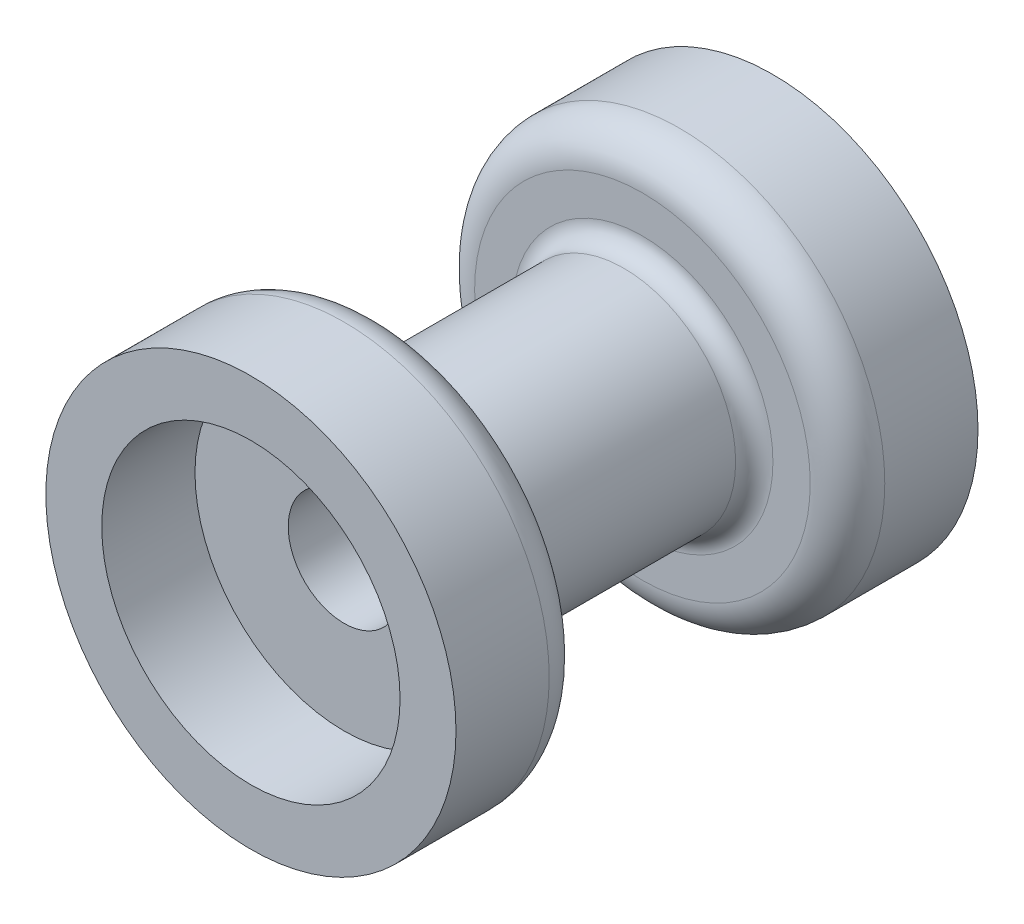
ISO-10303-21;
HEADER;
FILE_DESCRIPTION(('STEP AP214'),'2;1');
FILE_NAME('part.step','',(''),(''),'','','');
FILE_SCHEMA(('AUTOMOTIVE_DESIGN { 1 0 10303 214 1 1 1 1 }'));
ENDSEC;
DATA;
#1=APPLICATION_CONTEXT('core data for automotive mechanical design processes');
#2=APPLICATION_PROTOCOL_DEFINITION('international standard','automotive_design',2000,#1);
#3=PRODUCT_CONTEXT('',#1,'mechanical');
#4=PRODUCT('Part','Part','',(#3));
#5=PRODUCT_RELATED_PRODUCT_CATEGORY('part','',(#4));
#6=PRODUCT_DEFINITION_FORMATION('','',#4);
#7=PRODUCT_DEFINITION_CONTEXT('part definition',#1,'design');
#8=PRODUCT_DEFINITION('design','',#6,#7);
#9=PRODUCT_DEFINITION_SHAPE('','',#8);
#10=(LENGTH_UNIT() NAMED_UNIT(*) SI_UNIT(.MILLI.,.METRE.));
#11=(NAMED_UNIT(*) PLANE_ANGLE_UNIT() SI_UNIT($,.RADIAN.));
#12=(NAMED_UNIT(*) SI_UNIT($,.STERADIAN.) SOLID_ANGLE_UNIT());
#13=UNCERTAINTY_MEASURE_WITH_UNIT(LENGTH_MEASURE(1.E-05),#10,'distance_accuracy_value','');
#14=(GEOMETRIC_REPRESENTATION_CONTEXT(3) GLOBAL_UNCERTAINTY_ASSIGNED_CONTEXT((#13)) GLOBAL_UNIT_ASSIGNED_CONTEXT((#10,
#11,#12)) REPRESENTATION_CONTEXT('',''));
#15=CARTESIAN_POINT('',(0.,0.,0.));
#16=DIRECTION('',(0.,0.,1.));
#17=DIRECTION('',(1.,0.,0.));
#18=AXIS2_PLACEMENT_3D('',#15,#16,#17);
#19=CARTESIAN_POINT('',(0.,0.,0.));
#20=DIRECTION('',(0.,0.,1.));
#21=DIRECTION('',(1.,0.,0.));
#22=AXIS2_PLACEMENT_3D('',#19,#20,#21);
#23=CYLINDRICAL_SURFACE('',#22,8.);
#24=CARTESIAN_POINT('',(0.,0.,-5.));
#25=DIRECTION('',(0.,0.,1.));
#26=DIRECTION('',(1.,0.,0.));
#27=AXIS2_PLACEMENT_3D('',#24,#25,#26);
#28=CIRCLE('',#27,8.);
#29=CARTESIAN_POINT('',(8.,0.,-5.));
#30=VERTEX_POINT('',#29);
#31=EDGE_CURVE('E10',#30,#30,#28,.T.);
#32=ORIENTED_EDGE('',*,*,#31,.F.);
#33=EDGE_LOOP('',(#32));
#34=FACE_BOUND('',#33,.T.);
#35=CARTESIAN_POINT('',(0.,0.,0.));
#36=DIRECTION('',(0.,0.,1.));
#37=DIRECTION('',(1.,0.,0.));
#38=AXIS2_PLACEMENT_3D('',#35,#36,#37);
#39=CIRCLE('',#38,8.);
#40=CARTESIAN_POINT('',(8.,0.,0.));
#41=VERTEX_POINT('',#40);
#42=EDGE_CURVE('E83',#41,#41,#39,.T.);
#43=ORIENTED_EDGE('',*,*,#42,.T.);
#44=EDGE_LOOP('',(#43));
#45=FACE_BOUND('',#44,.T.);
#46=ADVANCED_FACE('F31',(#34,#45),#23,.F.);
#47=CARTESIAN_POINT('',(0.,3.,-5.));
#48=DIRECTION('',(0.,0.,-1.));
#49=DIRECTION('',(-1.,0.,0.));
#50=AXIS2_PLACEMENT_3D('',#47,#48,#49);
#51=PLANE('',#50);
#52=CARTESIAN_POINT('',(0.,0.,-5.));
#53=DIRECTION('',(0.,0.,1.));
#54=DIRECTION('',(1.,0.,0.));
#55=AXIS2_PLACEMENT_3D('',#52,#53,#54);
#56=CIRCLE('',#55,3.);
#57=CARTESIAN_POINT('',(3.,0.,-5.));
#58=VERTEX_POINT('',#57);
#59=EDGE_CURVE('E37',#58,#58,#56,.T.);
#60=ORIENTED_EDGE('',*,*,#59,.F.);
#61=EDGE_LOOP('',(#60));
#62=FACE_BOUND('',#61,.T.);
#63=ORIENTED_EDGE('',*,*,#31,.T.);
#64=EDGE_LOOP('',(#63));
#65=FACE_BOUND('',#64,.T.);
#66=ADVANCED_FACE('F168',(#62,#65),#51,.F.);
#67=CARTESIAN_POINT('',(0.,0.,0.));
#68=DIRECTION('',(0.,0.,1.));
#69=DIRECTION('',(1.,0.,0.));
#70=AXIS2_PLACEMENT_3D('',#67,#68,#69);
#71=CYLINDRICAL_SURFACE('',#70,3.);
#72=CARTESIAN_POINT('',(0.,0.,-23.));
#73=DIRECTION('',(0.,0.,1.));
#74=DIRECTION('',(1.,0.,0.));
#75=AXIS2_PLACEMENT_3D('',#72,#73,#74);
#76=CIRCLE('',#75,3.);
#77=CARTESIAN_POINT('',(3.,0.,-23.));
#78=VERTEX_POINT('',#77);
#79=EDGE_CURVE('E41',#78,#78,#76,.T.);
#80=ORIENTED_EDGE('',*,*,#79,.F.);
#81=EDGE_LOOP('',(#80));
#82=FACE_BOUND('',#81,.T.);
#83=ORIENTED_EDGE('',*,*,#59,.T.);
#84=EDGE_LOOP('',(#83));
#85=FACE_BOUND('',#84,.T.);
#86=ADVANCED_FACE('F163',(#82,#85),#71,.F.);
#87=CARTESIAN_POINT('',(0.,8.00000000000001,-23.));
#88=DIRECTION('',(0.,0.,1.));
#89=DIRECTION('',(1.,0.,0.));
#90=AXIS2_PLACEMENT_3D('',#87,#88,#89);
#91=PLANE('',#90);
#92=CARTESIAN_POINT('',(0.,0.,-23.));
#93=DIRECTION('',(0.,0.,1.));
#94=DIRECTION('',(1.,0.,0.));
#95=AXIS2_PLACEMENT_3D('',#92,#93,#94);
#96=CIRCLE('',#95,8.00000000000001);
#97=CARTESIAN_POINT('',(8.00000000000001,0.,-23.));
#98=VERTEX_POINT('',#97);
#99=EDGE_CURVE('E45',#98,#98,#96,.T.);
#100=ORIENTED_EDGE('',*,*,#99,.F.);
#101=EDGE_LOOP('',(#100));
#102=FACE_BOUND('',#101,.T.);
#103=ORIENTED_EDGE('',*,*,#79,.T.);
#104=EDGE_LOOP('',(#103));
#105=FACE_BOUND('',#104,.T.);
#106=ADVANCED_FACE('F157',(#102,#105),#91,.F.);
#107=CARTESIAN_POINT('',(0.,0.,0.));
#108=DIRECTION('',(0.,0.,1.));
#109=DIRECTION('',(1.,0.,0.));
#110=AXIS2_PLACEMENT_3D('',#107,#108,#109);
#111=CYLINDRICAL_SURFACE('',#110,8.);
#112=CARTESIAN_POINT('',(0.,0.,-28.));
#113=DIRECTION('',(0.,0.,1.));
#114=DIRECTION('',(1.,0.,0.));
#115=AXIS2_PLACEMENT_3D('',#112,#113,#114);
#116=CIRCLE('',#115,8.);
#117=CARTESIAN_POINT('',(8.,0.,-28.));
#118=VERTEX_POINT('',#117);
#119=EDGE_CURVE('E50',#118,#118,#116,.T.);
#120=ORIENTED_EDGE('',*,*,#119,.F.);
#121=EDGE_LOOP('',(#120));
#122=FACE_BOUND('',#121,.T.);
#123=ORIENTED_EDGE('',*,*,#99,.T.);
#124=EDGE_LOOP('',(#123));
#125=FACE_BOUND('',#124,.T.);
#126=ADVANCED_FACE('F151',(#122,#125),#111,.F.);
#127=CARTESIAN_POINT('',(0.,11.,-28.));
#128=DIRECTION('',(0.,0.,1.));
#129=DIRECTION('',(1.,0.,0.));
#130=AXIS2_PLACEMENT_3D('',#127,#128,#129);
#131=PLANE('',#130);
#132=CARTESIAN_POINT('',(0.,0.,-28.));
#133=DIRECTION('',(0.,0.,1.));
#134=DIRECTION('',(1.,0.,0.));
#135=AXIS2_PLACEMENT_3D('',#132,#133,#134);
#136=CIRCLE('',#135,11.);
#137=CARTESIAN_POINT('',(11.,0.,-28.));
#138=VERTEX_POINT('',#137);
#139=EDGE_CURVE('E53',#138,#138,#136,.T.);
#140=ORIENTED_EDGE('',*,*,#139,.F.);
#141=EDGE_LOOP('',(#140));
#142=FACE_BOUND('',#141,.T.);
#143=ORIENTED_EDGE('',*,*,#119,.T.);
#144=EDGE_LOOP('',(#143));
#145=FACE_BOUND('',#144,.T.);
#146=ADVANCED_FACE('F145',(#142,#145),#131,.F.);
#147=CARTESIAN_POINT('',(0.,0.,0.));
#148=DIRECTION('',(0.,0.,1.));
#149=DIRECTION('',(1.,0.,0.));
#150=AXIS2_PLACEMENT_3D('',#147,#148,#149);
#151=CYLINDRICAL_SURFACE('',#150,11.);
#152=CARTESIAN_POINT('',(0.,0.,-23.));
#153=DIRECTION('',(0.,0.,1.));
#154=DIRECTION('',(1.,0.,0.));
#155=AXIS2_PLACEMENT_3D('',#152,#153,#154);
#156=CIRCLE('',#155,11.);
#157=CARTESIAN_POINT('',(11.,0.,-23.));
#158=VERTEX_POINT('',#157);
#159=EDGE_CURVE('E56',#158,#158,#156,.T.);
#160=ORIENTED_EDGE('',*,*,#159,.F.);
#161=EDGE_LOOP('',(#160));
#162=FACE_BOUND('',#161,.T.);
#163=ORIENTED_EDGE('',*,*,#139,.T.);
#164=EDGE_LOOP('',(#163));
#165=FACE_BOUND('',#164,.T.);
#166=ADVANCED_FACE('F139',(#162,#165),#151,.T.);
#167=CARTESIAN_POINT('',(0.,0.,-23.));
#168=DIRECTION('',(0.,0.,1.));
#169=DIRECTION('',(1.,0.,0.));
#170=AXIS2_PLACEMENT_3D('',#167,#168,#169);
#171=TOROIDAL_SURFACE('',#170,9.,2.);
#172=CARTESIAN_POINT('',(0.,0.,-21.));
#173=DIRECTION('',(0.,0.,1.));
#174=DIRECTION('',(1.,0.,0.));
#175=AXIS2_PLACEMENT_3D('',#172,#173,#174);
#176=CIRCLE('',#175,9.);
#177=CARTESIAN_POINT('',(9.,0.,-21.));
#178=VERTEX_POINT('',#177);
#179=EDGE_CURVE('E59',#178,#178,#176,.T.);
#180=ORIENTED_EDGE('',*,*,#179,.F.);
#181=EDGE_LOOP('',(#180));
#182=FACE_BOUND('',#181,.T.);
#183=ORIENTED_EDGE('',*,*,#159,.T.);
#184=EDGE_LOOP('',(#183));
#185=FACE_BOUND('',#184,.T.);
#186=ADVANCED_FACE('F133',(#182,#185),#171,.T.);
#187=CARTESIAN_POINT('',(0.,7.,-21.));
#188=DIRECTION('',(0.,0.,-1.));
#189=DIRECTION('',(-1.,0.,0.));
#190=AXIS2_PLACEMENT_3D('',#187,#188,#189);
#191=PLANE('',#190);
#192=CARTESIAN_POINT('',(0.,0.,-21.));
#193=DIRECTION('',(0.,0.,1.));
#194=DIRECTION('',(1.,0.,0.));
#195=AXIS2_PLACEMENT_3D('',#192,#193,#194);
#196=CIRCLE('',#195,7.);
#197=CARTESIAN_POINT('',(7.,0.,-21.));
#198=VERTEX_POINT('',#197);
#199=EDGE_CURVE('E62',#198,#198,#196,.T.);
#200=ORIENTED_EDGE('',*,*,#199,.F.);
#201=EDGE_LOOP('',(#200));
#202=FACE_BOUND('',#201,.T.);
#203=ORIENTED_EDGE('',*,*,#179,.T.);
#204=EDGE_LOOP('',(#203));
#205=FACE_BOUND('',#204,.T.);
#206=ADVANCED_FACE('F127',(#202,#205),#191,.F.);
#207=CARTESIAN_POINT('',(0.,0.,-20.));
#208=DIRECTION('',(0.,0.,1.));
#209=DIRECTION('',(1.,0.,0.));
#210=AXIS2_PLACEMENT_3D('',#207,#208,#209);
#211=TOROIDAL_SURFACE('',#210,7.,1.);
#212=CARTESIAN_POINT('',(0.,0.,-20.));
#213=DIRECTION('',(0.,0.,1.));
#214=DIRECTION('',(1.,0.,0.));
#215=AXIS2_PLACEMENT_3D('',#212,#213,#214);
#216=CIRCLE('',#215,6.);
#217=CARTESIAN_POINT('',(6.,0.,-20.));
#218=VERTEX_POINT('',#217);
#219=EDGE_CURVE('E65',#218,#218,#216,.T.);
#220=ORIENTED_EDGE('',*,*,#219,.F.);
#221=EDGE_LOOP('',(#220));
#222=FACE_BOUND('',#221,.T.);
#223=ORIENTED_EDGE('',*,*,#199,.T.);
#224=EDGE_LOOP('',(#223));
#225=FACE_BOUND('',#224,.T.);
#226=ADVANCED_FACE('F121',(#222,#225),#211,.F.);
#227=CARTESIAN_POINT('',(0.,0.,0.));
#228=DIRECTION('',(0.,0.,1.));
#229=DIRECTION('',(1.,0.,0.));
#230=AXIS2_PLACEMENT_3D('',#227,#228,#229);
#231=CYLINDRICAL_SURFACE('',#230,6.);
#232=CARTESIAN_POINT('',(0.,0.,-8.));
#233=DIRECTION('',(0.,0.,1.));
#234=DIRECTION('',(1.,0.,0.));
#235=AXIS2_PLACEMENT_3D('',#232,#233,#234);
#236=CIRCLE('',#235,6.);
#237=CARTESIAN_POINT('',(6.,0.,-8.));
#238=VERTEX_POINT('',#237);
#239=EDGE_CURVE('E68',#238,#238,#236,.T.);
#240=ORIENTED_EDGE('',*,*,#239,.F.);
#241=EDGE_LOOP('',(#240));
#242=FACE_BOUND('',#241,.T.);
#243=ORIENTED_EDGE('',*,*,#219,.T.);
#244=EDGE_LOOP('',(#243));
#245=FACE_BOUND('',#244,.T.);
#246=ADVANCED_FACE('F115',(#242,#245),#231,.T.);
#247=CARTESIAN_POINT('',(0.,0.,-8.));
#248=DIRECTION('',(0.,0.,1.));
#249=DIRECTION('',(1.,0.,0.));
#250=AXIS2_PLACEMENT_3D('',#247,#248,#249);
#251=TOROIDAL_SURFACE('',#250,7.,1.);
#252=CARTESIAN_POINT('',(0.,0.,-7.));
#253=DIRECTION('',(0.,0.,1.));
#254=DIRECTION('',(1.,0.,0.));
#255=AXIS2_PLACEMENT_3D('',#252,#253,#254);
#256=CIRCLE('',#255,7.);
#257=CARTESIAN_POINT('',(7.,0.,-7.));
#258=VERTEX_POINT('',#257);
#259=EDGE_CURVE('E71',#258,#258,#256,.T.);
#260=ORIENTED_EDGE('',*,*,#259,.F.);
#261=EDGE_LOOP('',(#260));
#262=FACE_BOUND('',#261,.T.);
#263=ORIENTED_EDGE('',*,*,#239,.T.);
#264=EDGE_LOOP('',(#263));
#265=FACE_BOUND('',#264,.T.);
#266=ADVANCED_FACE('F109',(#262,#265),#251,.F.);
#267=CARTESIAN_POINT('',(0.,9.,-7.));
#268=DIRECTION('',(0.,0.,1.));
#269=DIRECTION('',(1.,0.,0.));
#270=AXIS2_PLACEMENT_3D('',#267,#268,#269);
#271=PLANE('',#270);
#272=CARTESIAN_POINT('',(0.,0.,-7.));
#273=DIRECTION('',(0.,0.,1.));
#274=DIRECTION('',(1.,0.,0.));
#275=AXIS2_PLACEMENT_3D('',#272,#273,#274);
#276=CIRCLE('',#275,9.);
#277=CARTESIAN_POINT('',(9.,0.,-7.));
#278=VERTEX_POINT('',#277);
#279=EDGE_CURVE('E74',#278,#278,#276,.T.);
#280=ORIENTED_EDGE('',*,*,#279,.F.);
#281=EDGE_LOOP('',(#280));
#282=FACE_BOUND('',#281,.T.);
#283=ORIENTED_EDGE('',*,*,#259,.T.);
#284=EDGE_LOOP('',(#283));
#285=FACE_BOUND('',#284,.T.);
#286=ADVANCED_FACE('F103',(#282,#285),#271,.F.);
#287=CARTESIAN_POINT('',(0.,0.,-5.));
#288=DIRECTION('',(0.,0.,1.));
#289=DIRECTION('',(1.,0.,0.));
#290=AXIS2_PLACEMENT_3D('',#287,#288,#289);
#291=TOROIDAL_SURFACE('',#290,9.,2.);
#292=CARTESIAN_POINT('',(0.,0.,-5.));
#293=DIRECTION('',(0.,0.,1.));
#294=DIRECTION('',(1.,0.,0.));
#295=AXIS2_PLACEMENT_3D('',#292,#293,#294);
#296=CIRCLE('',#295,11.);
#297=CARTESIAN_POINT('',(11.,0.,-5.));
#298=VERTEX_POINT('',#297);
#299=EDGE_CURVE('E77',#298,#298,#296,.T.);
#300=ORIENTED_EDGE('',*,*,#299,.F.);
#301=EDGE_LOOP('',(#300));
#302=FACE_BOUND('',#301,.T.);
#303=ORIENTED_EDGE('',*,*,#279,.T.);
#304=EDGE_LOOP('',(#303));
#305=FACE_BOUND('',#304,.T.);
#306=ADVANCED_FACE('F97',(#302,#305),#291,.T.);
#307=CARTESIAN_POINT('',(0.,0.,0.));
#308=DIRECTION('',(0.,0.,1.));
#309=DIRECTION('',(1.,0.,0.));
#310=AXIS2_PLACEMENT_3D('',#307,#308,#309);
#311=CYLINDRICAL_SURFACE('',#310,11.);
#312=CARTESIAN_POINT('',(0.,0.,0.));
#313=DIRECTION('',(0.,0.,1.));
#314=DIRECTION('',(1.,0.,0.));
#315=AXIS2_PLACEMENT_3D('',#312,#313,#314);
#316=CIRCLE('',#315,11.);
#317=CARTESIAN_POINT('',(11.,0.,0.));
#318=VERTEX_POINT('',#317);
#319=EDGE_CURVE('E80',#318,#318,#316,.T.);
#320=ORIENTED_EDGE('',*,*,#319,.F.);
#321=EDGE_LOOP('',(#320));
#322=FACE_BOUND('',#321,.T.);
#323=ORIENTED_EDGE('',*,*,#299,.T.);
#324=EDGE_LOOP('',(#323));
#325=FACE_BOUND('',#324,.T.);
#326=ADVANCED_FACE('F91',(#322,#325),#311,.T.);
#327=CARTESIAN_POINT('',(0.,8.,0.));
#328=DIRECTION('',(0.,0.,-1.));
#329=DIRECTION('',(-1.,0.,0.));
#330=AXIS2_PLACEMENT_3D('',#327,#328,#329);
#331=PLANE('',#330);
#332=ORIENTED_EDGE('',*,*,#42,.F.);
#333=EDGE_LOOP('',(#332));
#334=FACE_BOUND('',#333,.T.);
#335=ORIENTED_EDGE('',*,*,#319,.T.);
#336=EDGE_LOOP('',(#335));
#337=FACE_BOUND('',#336,.T.);
#338=ADVANCED_FACE('F88',(#334,#337),#331,.F.);
#339=CLOSED_SHELL('',(#46,#66,#86,#106,#126,#146,#166,#186,#206,#226,#246,#266,#286,#306,#326,#338));
#340=MANIFOLD_SOLID_BREP('B2',#339);
#341=ADVANCED_BREP_SHAPE_REPRESENTATION('',(#18,#340),#14);
#342=SHAPE_DEFINITION_REPRESENTATION(#9,#341);
ENDSEC;
END-ISO-10303-21;
